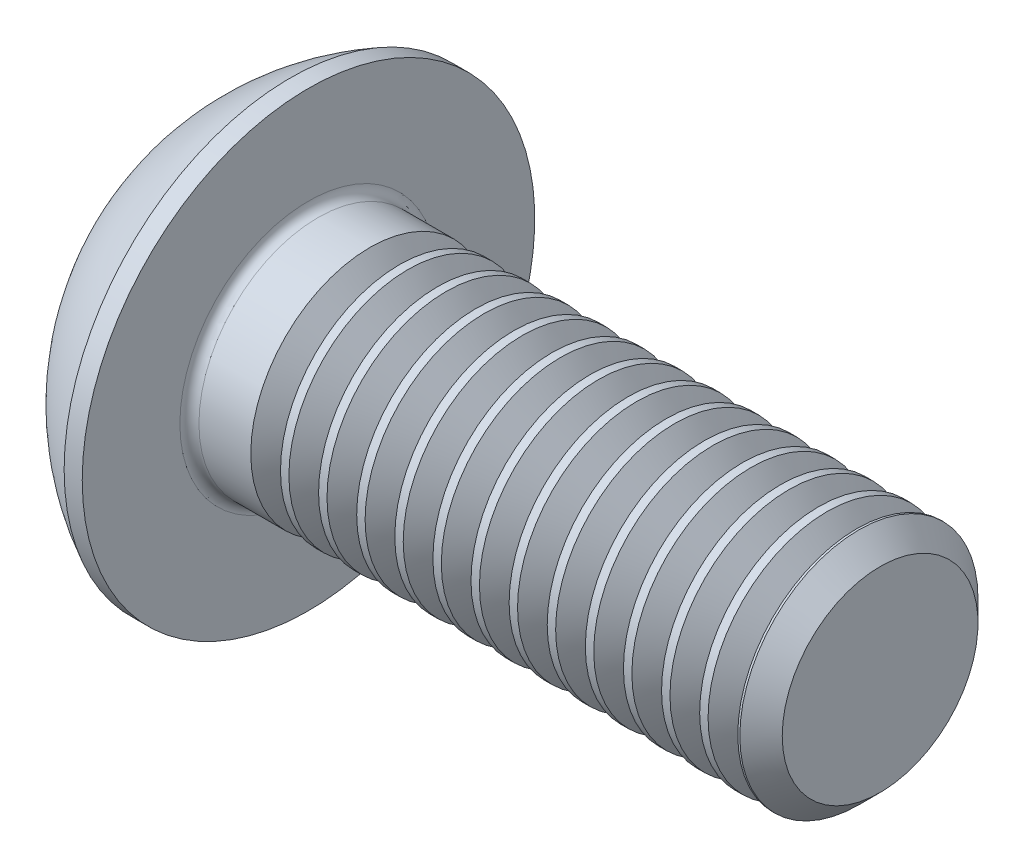
ISO-10303-21;
HEADER;
FILE_DESCRIPTION(('STEP AP214'),'2;1');
FILE_NAME('part.step','',(''),(''),'','','');
FILE_SCHEMA(('AUTOMOTIVE_DESIGN { 1 0 10303 214 1 1 1 1 }'));
ENDSEC;
DATA;
#1=APPLICATION_CONTEXT('core data for automotive mechanical design processes');
#2=APPLICATION_PROTOCOL_DEFINITION('international standard','automotive_design',2000,#1);
#3=PRODUCT_CONTEXT('',#1,'mechanical');
#4=PRODUCT('Part','Part','',(#3));
#5=PRODUCT_RELATED_PRODUCT_CATEGORY('part','',(#4));
#6=PRODUCT_DEFINITION_FORMATION('','',#4);
#7=PRODUCT_DEFINITION_CONTEXT('part definition',#1,'design');
#8=PRODUCT_DEFINITION('design','',#6,#7);
#9=PRODUCT_DEFINITION_SHAPE('','',#8);
#10=(LENGTH_UNIT() NAMED_UNIT(*) SI_UNIT(.MILLI.,.METRE.));
#11=(NAMED_UNIT(*) PLANE_ANGLE_UNIT() SI_UNIT($,.RADIAN.));
#12=(NAMED_UNIT(*) SI_UNIT($,.STERADIAN.) SOLID_ANGLE_UNIT());
#13=UNCERTAINTY_MEASURE_WITH_UNIT(LENGTH_MEASURE(1.E-05),#10,'distance_accuracy_value','');
#14=(GEOMETRIC_REPRESENTATION_CONTEXT(3) GLOBAL_UNCERTAINTY_ASSIGNED_CONTEXT((#13)) GLOBAL_UNIT_ASSIGNED_CONTEXT((#10,
#11,#12)) REPRESENTATION_CONTEXT('',''));
#15=CARTESIAN_POINT('',(0.,0.,0.));
#16=DIRECTION('',(0.,0.,1.));
#17=DIRECTION('',(1.,0.,0.));
#18=AXIS2_PLACEMENT_3D('',#15,#16,#17);
#19=CARTESIAN_POINT('',(0.,0.,0.));
#20=DIRECTION('',(-1.,0.,0.));
#21=DIRECTION('',(0.,0.,1.));
#22=AXIS2_PLACEMENT_3D('',#19,#20,#21);
#23=PLANE('',#22);
#24=CARTESIAN_POINT('',(0.,0.,0.));
#25=DIRECTION('',(-1.,0.,0.));
#26=DIRECTION('',(0.,0.,1.));
#27=AXIS2_PLACEMENT_3D('',#24,#25,#26);
#28=CIRCLE('',#27,2.375);
#29=CARTESIAN_POINT('',(0.,0.,2.375));
#30=VERTEX_POINT('',#29);
#31=EDGE_CURVE('E150',#30,#30,#28,.T.);
#32=ORIENTED_EDGE('',*,*,#31,.T.);
#33=EDGE_LOOP('',(#32));
#34=FACE_BOUND('',#33,.T.);
#35=DIRECTION('',(0.,-1.,0.));
#36=VECTOR('',#35,1.);
#37=CARTESIAN_POINT('',(0.,-0.866025403784438,1.5));
#38=LINE('',#37,#36);
#39=CARTESIAN_POINT('',(0.,0.86602540378444,1.5));
#40=VERTEX_POINT('',#39);
#41=CARTESIAN_POINT('',(0.,-0.866025403784438,1.5));
#42=VERTEX_POINT('',#41);
#43=EDGE_CURVE('E45',#40,#42,#38,.T.);
#44=ORIENTED_EDGE('',*,*,#43,.T.);
#45=DIRECTION('',(0.,-0.5,-0.866025403784439));
#46=VECTOR('',#45,1.);
#47=CARTESIAN_POINT('',(0.,-1.73205080756888,0.));
#48=LINE('',#47,#46);
#49=CARTESIAN_POINT('',(0.,-1.73205080756888,0.));
#50=VERTEX_POINT('',#49);
#51=EDGE_CURVE('E457',#42,#50,#48,.T.);
#52=ORIENTED_EDGE('',*,*,#51,.T.);
#53=DIRECTION('',(0.,0.5,-0.866025403784438));
#54=VECTOR('',#53,1.);
#55=CARTESIAN_POINT('',(0.,-0.866025403784438,-1.5));
#56=LINE('',#55,#54);
#57=CARTESIAN_POINT('',(0.,-0.866025403784438,-1.5));
#58=VERTEX_POINT('',#57);
#59=EDGE_CURVE('E125',#50,#58,#56,.T.);
#60=ORIENTED_EDGE('',*,*,#59,.T.);
#61=DIRECTION('',(0.,1.,0.));
#62=VECTOR('',#61,1.);
#63=CARTESIAN_POINT('',(0.,0.86602540378444,-1.5));
#64=LINE('',#63,#62);
#65=CARTESIAN_POINT('',(0.,0.86602540378444,-1.5));
#66=VERTEX_POINT('',#65);
#67=EDGE_CURVE('E477',#58,#66,#64,.T.);
#68=ORIENTED_EDGE('',*,*,#67,.T.);
#69=DIRECTION('',(0.,0.5,0.866025403784439));
#70=VECTOR('',#69,1.);
#71=CARTESIAN_POINT('',(0.,1.73205080756888,0.));
#72=LINE('',#71,#70);
#73=CARTESIAN_POINT('',(0.,1.73205080756888,0.));
#74=VERTEX_POINT('',#73);
#75=EDGE_CURVE('E479',#66,#74,#72,.T.);
#76=ORIENTED_EDGE('',*,*,#75,.T.);
#77=DIRECTION('',(0.,-0.5,0.866025403784439));
#78=VECTOR('',#77,1.);
#79=CARTESIAN_POINT('',(0.,0.86602540378444,1.5));
#80=LINE('',#79,#78);
#81=EDGE_CURVE('E481',#74,#40,#80,.T.);
#82=ORIENTED_EDGE('',*,*,#81,.T.);
#83=EDGE_LOOP('',(#44,#52,#60,#68,#76,#82));
#84=FACE_BOUND('',#83,.T.);
#85=ADVANCED_FACE('F30',(#34,#84),#23,.T.);
#86=CARTESIAN_POINT('',(4.75501582278481,0.,0.));
#87=DIRECTION('',(-1.,0.,0.));
#88=DIRECTION('',(0.,1.,0.));
#89=AXIS2_PLACEMENT_3D('',#86,#87,#88);
#90=SPHERICAL_SURFACE('',#89,5.3151482081814);
#91=CARTESIAN_POINT('',(2.37,0.,0.));
#92=DIRECTION('',(-1.,0.,0.));
#93=DIRECTION('',(0.,0.,1.));
#94=AXIS2_PLACEMENT_3D('',#91,#92,#93);
#95=CIRCLE('',#94,4.75);
#96=CARTESIAN_POINT('',(2.37,0.,4.75));
#97=VERTEX_POINT('',#96);
#98=EDGE_CURVE('E147',#97,#97,#95,.T.);
#99=ORIENTED_EDGE('',*,*,#98,.T.);
#100=EDGE_LOOP('',(#99));
#101=FACE_BOUND('',#100,.T.);
#102=ORIENTED_EDGE('',*,*,#31,.F.);
#103=EDGE_LOOP('',(#102));
#104=FACE_BOUND('',#103,.T.);
#105=ADVANCED_FACE('F172',(#101,#104),#90,.T.);
#106=CARTESIAN_POINT('',(0.,0.,0.));
#107=DIRECTION('',(-1.,0.,0.));
#108=DIRECTION('',(0.,0.,1.));
#109=AXIS2_PLACEMENT_3D('',#106,#107,#108);
#110=CYLINDRICAL_SURFACE('',#109,4.75);
#111=ORIENTED_EDGE('',*,*,#98,.F.);
#112=EDGE_LOOP('',(#111));
#113=FACE_BOUND('',#112,.T.);
#114=CARTESIAN_POINT('',(2.75,0.,0.));
#115=DIRECTION('',(-1.,0.,0.));
#116=DIRECTION('',(0.,0.,1.));
#117=AXIS2_PLACEMENT_3D('',#114,#115,#116);
#118=CIRCLE('',#117,4.75);
#119=CARTESIAN_POINT('',(2.75,0.,4.75));
#120=VERTEX_POINT('',#119);
#121=EDGE_CURVE('E144',#120,#120,#118,.T.);
#122=ORIENTED_EDGE('',*,*,#121,.T.);
#123=EDGE_LOOP('',(#122));
#124=FACE_BOUND('',#123,.T.);
#125=ADVANCED_FACE('F177',(#113,#124),#110,.T.);
#126=CARTESIAN_POINT('',(2.75,2.49999999999999,0.));
#127=DIRECTION('',(-1.,0.,0.));
#128=DIRECTION('',(0.,0.,1.));
#129=AXIS2_PLACEMENT_3D('',#126,#127,#128);
#130=PLANE('',#129);
#131=CARTESIAN_POINT('',(2.75,0.,0.));
#132=DIRECTION('',(-1.,0.,0.));
#133=DIRECTION('',(0.,0.,1.));
#134=AXIS2_PLACEMENT_3D('',#131,#132,#133);
#135=CIRCLE('',#134,2.69999999999999);
#136=CARTESIAN_POINT('',(2.75,0.,2.69999999999999));
#137=VERTEX_POINT('',#136);
#138=EDGE_CURVE('E38',#137,#137,#135,.T.);
#139=ORIENTED_EDGE('',*,*,#138,.T.);
#140=EDGE_LOOP('',(#139));
#141=FACE_BOUND('',#140,.T.);
#142=ORIENTED_EDGE('',*,*,#121,.F.);
#143=EDGE_LOOP('',(#142));
#144=FACE_BOUND('',#143,.T.);
#145=ADVANCED_FACE('F155',(#141,#144),#130,.F.);
#146=CARTESIAN_POINT('',(0.,0.,0.));
#147=DIRECTION('',(-1.,0.,0.));
#148=DIRECTION('',(0.,0.,1.));
#149=AXIS2_PLACEMENT_3D('',#146,#147,#148);
#150=CYLINDRICAL_SURFACE('',#149,2.49999999999999);
#151=CARTESIAN_POINT('',(4.03840764549667,0.,0.));
#152=DIRECTION('',(-1.,0.,0.));
#153=DIRECTION('',(0.,-1.,0.));
#154=AXIS2_PLACEMENT_3D('',#151,#152,#153);
#155=CIRCLE('',#154,2.5);
#156=CARTESIAN_POINT('',(4.03840764549667,-2.5,0.));
#157=VERTEX_POINT('',#156);
#158=EDGE_CURVE('E452',#157,#157,#155,.T.);
#159=ORIENTED_EDGE('',*,*,#158,.T.);
#160=EDGE_LOOP('',(#159));
#161=FACE_BOUND('',#160,.T.);
#162=CARTESIAN_POINT('',(2.95,0.,0.));
#163=DIRECTION('',(-1.,0.,0.));
#164=DIRECTION('',(0.,0.,1.));
#165=AXIS2_PLACEMENT_3D('',#162,#163,#164);
#166=CIRCLE('',#165,2.49999999999999);
#167=CARTESIAN_POINT('',(2.95,0.,2.49999999999999));
#168=VERTEX_POINT('',#167);
#169=EDGE_CURVE('E11',#168,#168,#166,.F.);
#170=ORIENTED_EDGE('',*,*,#169,.T.);
#171=EDGE_LOOP('',(#170));
#172=FACE_BOUND('',#171,.T.);
#173=ADVANCED_FACE('F159',(#161,#172),#150,.T.);
#174=CARTESIAN_POINT('',(2.95,0.,0.));
#175=DIRECTION('',(-1.,0.,0.));
#176=DIRECTION('',(0.,0.,1.));
#177=AXIS2_PLACEMENT_3D('',#174,#175,#176);
#178=TOROIDAL_SURFACE('',#177,2.69999999999999,0.2);
#179=ORIENTED_EDGE('',*,*,#169,.F.);
#180=EDGE_LOOP('',(#179));
#181=FACE_BOUND('',#180,.T.);
#182=ORIENTED_EDGE('',*,*,#138,.F.);
#183=EDGE_LOOP('',(#182));
#184=FACE_BOUND('',#183,.T.);
#185=ADVANCED_FACE('F32',(#181,#184),#178,.F.);
#186=CARTESIAN_POINT('',(1.56,-1.73205080756888,0.));
#187=DIRECTION('',(0.,0.866025403784438,-0.5));
#188=DIRECTION('',(0.,0.5,0.866025403784439));
#189=AXIS2_PLACEMENT_3D('',#186,#187,#188);
#190=PLANE('',#189);
#191=DIRECTION('',(0.,-0.5,-0.866025403784439));
#192=VECTOR('',#191,1.);
#193=CARTESIAN_POINT('',(1.56,-1.73205080756888,0.));
#194=LINE('',#193,#192);
#195=CARTESIAN_POINT('',(1.56,-0.866025403784438,1.5));
#196=VERTEX_POINT('',#195);
#197=CARTESIAN_POINT('',(1.56,-1.29903810567666,0.75));
#198=VERTEX_POINT('',#197);
#199=EDGE_CURVE('E111',#196,#198,#194,.T.);
#200=ORIENTED_EDGE('',*,*,#199,.T.);
#201=CARTESIAN_POINT('',(1.56,-1.73205080756888,0.));
#202=VERTEX_POINT('',#201);
#203=EDGE_CURVE('E106',#198,#202,#194,.T.);
#204=ORIENTED_EDGE('',*,*,#203,.T.);
#205=DIRECTION('',(-1.,0.,0.));
#206=VECTOR('',#205,1.);
#207=CARTESIAN_POINT('',(1.56,-1.73205080756888,0.));
#208=LINE('',#207,#206);
#209=EDGE_CURVE('E108',#202,#50,#208,.T.);
#210=ORIENTED_EDGE('',*,*,#209,.T.);
#211=ORIENTED_EDGE('',*,*,#51,.F.);
#212=DIRECTION('',(-1.,0.,0.));
#213=VECTOR('',#212,1.);
#214=CARTESIAN_POINT('',(1.56,-0.866025403784438,1.5));
#215=LINE('',#214,#213);
#216=EDGE_CURVE('E474',#196,#42,#215,.T.);
#217=ORIENTED_EDGE('',*,*,#216,.F.);
#218=EDGE_LOOP('',(#200,#204,#210,#211,#217));
#219=FACE_BOUND('',#218,.T.);
#220=ADVANCED_FACE('F107',(#219),#190,.T.);
#221=CARTESIAN_POINT('',(1.56,-0.866025403784438,-1.5));
#222=DIRECTION('',(0.,0.866025403784438,0.5));
#223=DIRECTION('',(0.,-0.5,0.866025403784439));
#224=AXIS2_PLACEMENT_3D('',#221,#222,#223);
#225=PLANE('',#224);
#226=DIRECTION('',(0.,0.5,-0.866025403784438));
#227=VECTOR('',#226,1.);
#228=CARTESIAN_POINT('',(1.56,-0.866025403784438,-1.5));
#229=LINE('',#228,#227);
#230=CARTESIAN_POINT('',(1.56,-1.29903810567666,-0.75));
#231=VERTEX_POINT('',#230);
#232=EDGE_CURVE('E53',#202,#231,#229,.T.);
#233=ORIENTED_EDGE('',*,*,#232,.T.);
#234=CARTESIAN_POINT('',(1.56,-0.866025403784438,-1.5));
#235=VERTEX_POINT('',#234);
#236=EDGE_CURVE('E120',#231,#235,#229,.T.);
#237=ORIENTED_EDGE('',*,*,#236,.T.);
#238=DIRECTION('',(-1.,0.,0.));
#239=VECTOR('',#238,1.);
#240=CARTESIAN_POINT('',(1.56,-0.866025403784438,-1.5));
#241=LINE('',#240,#239);
#242=EDGE_CURVE('E127',#235,#58,#241,.T.);
#243=ORIENTED_EDGE('',*,*,#242,.T.);
#244=ORIENTED_EDGE('',*,*,#59,.F.);
#245=ORIENTED_EDGE('',*,*,#209,.F.);
#246=EDGE_LOOP('',(#233,#237,#243,#244,#245));
#247=FACE_BOUND('',#246,.T.);
#248=ADVANCED_FACE('F123',(#247),#225,.T.);
#249=CARTESIAN_POINT('',(1.56,0.86602540378444,-1.5));
#250=DIRECTION('',(0.,0.,1.));
#251=DIRECTION('',(1.,0.,0.));
#252=AXIS2_PLACEMENT_3D('',#249,#250,#251);
#253=PLANE('',#252);
#254=DIRECTION('',(0.,1.,0.));
#255=VECTOR('',#254,1.);
#256=CARTESIAN_POINT('',(1.56,0.86602540378444,-1.5));
#257=LINE('',#256,#255);
#258=CARTESIAN_POINT('',(1.56,0.,-1.5));
#259=VERTEX_POINT('',#258);
#260=EDGE_CURVE('E459',#235,#259,#257,.T.);
#261=ORIENTED_EDGE('',*,*,#260,.T.);
#262=CARTESIAN_POINT('',(1.56,0.86602540378444,-1.5));
#263=VERTEX_POINT('',#262);
#264=EDGE_CURVE('E119',#259,#263,#257,.T.);
#265=ORIENTED_EDGE('',*,*,#264,.T.);
#266=DIRECTION('',(-1.,0.,0.));
#267=VECTOR('',#266,1.);
#268=CARTESIAN_POINT('',(1.56,0.86602540378444,-1.5));
#269=LINE('',#268,#267);
#270=EDGE_CURVE('E132',#263,#66,#269,.T.);
#271=ORIENTED_EDGE('',*,*,#270,.T.);
#272=ORIENTED_EDGE('',*,*,#67,.F.);
#273=ORIENTED_EDGE('',*,*,#242,.F.);
#274=EDGE_LOOP('',(#261,#265,#271,#272,#273));
#275=FACE_BOUND('',#274,.T.);
#276=ADVANCED_FACE('F203',(#275),#253,.T.);
#277=CARTESIAN_POINT('',(1.56,1.73205080756888,0.));
#278=DIRECTION('',(0.,-0.866025403784439,0.5));
#279=DIRECTION('',(0.,-0.5,-0.866025403784439));
#280=AXIS2_PLACEMENT_3D('',#277,#278,#279);
#281=PLANE('',#280);
#282=DIRECTION('',(0.,0.5,0.866025403784439));
#283=VECTOR('',#282,1.);
#284=CARTESIAN_POINT('',(1.56,1.73205080756888,0.));
#285=LINE('',#284,#283);
#286=CARTESIAN_POINT('',(1.56,1.29903810567666,-0.750000000000001));
#287=VERTEX_POINT('',#286);
#288=EDGE_CURVE('E463',#263,#287,#285,.T.);
#289=ORIENTED_EDGE('',*,*,#288,.T.);
#290=CARTESIAN_POINT('',(1.56,1.73205080756888,0.));
#291=VERTEX_POINT('',#290);
#292=EDGE_CURVE('E462',#287,#291,#285,.T.);
#293=ORIENTED_EDGE('',*,*,#292,.T.);
#294=DIRECTION('',(-1.,0.,0.));
#295=VECTOR('',#294,1.);
#296=CARTESIAN_POINT('',(1.56,1.73205080756888,0.));
#297=LINE('',#296,#295);
#298=EDGE_CURVE('E489',#291,#74,#297,.T.);
#299=ORIENTED_EDGE('',*,*,#298,.T.);
#300=ORIENTED_EDGE('',*,*,#75,.F.);
#301=ORIENTED_EDGE('',*,*,#270,.F.);
#302=EDGE_LOOP('',(#289,#293,#299,#300,#301));
#303=FACE_BOUND('',#302,.T.);
#304=ADVANCED_FACE('F206',(#303),#281,.T.);
#305=CARTESIAN_POINT('',(1.56,0.86602540378444,1.5));
#306=DIRECTION('',(0.,-0.866025403784439,-0.5));
#307=DIRECTION('',(0.,0.5,-0.866025403784439));
#308=AXIS2_PLACEMENT_3D('',#305,#306,#307);
#309=PLANE('',#308);
#310=DIRECTION('',(0.,-0.5,0.866025403784439));
#311=VECTOR('',#310,1.);
#312=CARTESIAN_POINT('',(1.56,0.86602540378444,1.5));
#313=LINE('',#312,#311);
#314=CARTESIAN_POINT('',(1.56,1.29903810567666,0.75));
#315=VERTEX_POINT('',#314);
#316=EDGE_CURVE('E467',#291,#315,#313,.T.);
#317=ORIENTED_EDGE('',*,*,#316,.T.);
#318=CARTESIAN_POINT('',(1.56,0.86602540378444,1.5));
#319=VERTEX_POINT('',#318);
#320=EDGE_CURVE('E466',#315,#319,#313,.T.);
#321=ORIENTED_EDGE('',*,*,#320,.T.);
#322=DIRECTION('',(-1.,0.,0.));
#323=VECTOR('',#322,1.);
#324=CARTESIAN_POINT('',(1.56,0.86602540378444,1.5));
#325=LINE('',#324,#323);
#326=EDGE_CURVE('E486',#319,#40,#325,.T.);
#327=ORIENTED_EDGE('',*,*,#326,.T.);
#328=ORIENTED_EDGE('',*,*,#81,.F.);
#329=ORIENTED_EDGE('',*,*,#298,.F.);
#330=EDGE_LOOP('',(#317,#321,#327,#328,#329));
#331=FACE_BOUND('',#330,.T.);
#332=ADVANCED_FACE('F210',(#331),#309,.T.);
#333=CARTESIAN_POINT('',(1.56,-0.866025403784438,1.5));
#334=DIRECTION('',(0.,0.,-1.));
#335=DIRECTION('',(0.,1.,0.));
#336=AXIS2_PLACEMENT_3D('',#333,#334,#335);
#337=PLANE('',#336);
#338=DIRECTION('',(0.,-1.,0.));
#339=VECTOR('',#338,1.);
#340=CARTESIAN_POINT('',(1.56,-0.866025403784438,1.5));
#341=LINE('',#340,#339);
#342=CARTESIAN_POINT('',(1.56,0.,1.5));
#343=VERTEX_POINT('',#342);
#344=EDGE_CURVE('E471',#319,#343,#341,.T.);
#345=ORIENTED_EDGE('',*,*,#344,.T.);
#346=EDGE_CURVE('E470',#343,#196,#341,.T.);
#347=ORIENTED_EDGE('',*,*,#346,.T.);
#348=ORIENTED_EDGE('',*,*,#216,.T.);
#349=ORIENTED_EDGE('',*,*,#43,.F.);
#350=ORIENTED_EDGE('',*,*,#326,.F.);
#351=EDGE_LOOP('',(#345,#347,#348,#349,#350));
#352=FACE_BOUND('',#351,.T.);
#353=ADVANCED_FACE('F214',(#352),#337,.T.);
#354=CARTESIAN_POINT('',(1.56,-1.73205080756888,0.));
#355=DIRECTION('',(1.,0.,0.));
#356=DIRECTION('',(0.,0.,-1.));
#357=AXIS2_PLACEMENT_3D('',#354,#355,#356);
#358=PLANE('',#357);
#359=CARTESIAN_POINT('',(1.56,0.,0.));
#360=DIRECTION('',(-1.,0.,0.));
#361=DIRECTION('',(0.,0.,1.));
#362=AXIS2_PLACEMENT_3D('',#359,#360,#361);
#363=CIRCLE('',#362,1.5);
#364=EDGE_CURVE('E503',#287,#259,#363,.T.);
#365=ORIENTED_EDGE('',*,*,#364,.F.);
#366=ORIENTED_EDGE('',*,*,#288,.F.);
#367=ORIENTED_EDGE('',*,*,#264,.F.);
#368=EDGE_LOOP('',(#365,#366,#367));
#369=FACE_BOUND('',#368,.T.);
#370=ADVANCED_FACE('F218',(#369),#358,.F.);
#371=EDGE_CURVE('E138',#315,#287,#363,.T.);
#372=ORIENTED_EDGE('',*,*,#371,.F.);
#373=ORIENTED_EDGE('',*,*,#316,.F.);
#374=ORIENTED_EDGE('',*,*,#292,.F.);
#375=EDGE_LOOP('',(#372,#373,#374));
#376=FACE_BOUND('',#375,.T.);
#377=ADVANCED_FACE('F511',(#376),#358,.F.);
#378=EDGE_CURVE('E131',#343,#315,#363,.T.);
#379=ORIENTED_EDGE('',*,*,#378,.F.);
#380=ORIENTED_EDGE('',*,*,#344,.F.);
#381=ORIENTED_EDGE('',*,*,#320,.F.);
#382=EDGE_LOOP('',(#379,#380,#381));
#383=FACE_BOUND('',#382,.T.);
#384=ADVANCED_FACE('F514',(#383),#358,.F.);
#385=EDGE_CURVE('E126',#198,#343,#363,.T.);
#386=ORIENTED_EDGE('',*,*,#385,.F.);
#387=ORIENTED_EDGE('',*,*,#199,.F.);
#388=ORIENTED_EDGE('',*,*,#346,.F.);
#389=EDGE_LOOP('',(#386,#387,#388));
#390=FACE_BOUND('',#389,.T.);
#391=ADVANCED_FACE('F518',(#390),#358,.F.);
#392=EDGE_CURVE('E117',#231,#198,#363,.T.);
#393=ORIENTED_EDGE('',*,*,#392,.F.);
#394=ORIENTED_EDGE('',*,*,#232,.F.);
#395=ORIENTED_EDGE('',*,*,#203,.F.);
#396=EDGE_LOOP('',(#393,#394,#395));
#397=FACE_BOUND('',#396,.T.);
#398=ADVANCED_FACE('F116',(#397),#358,.F.);
#399=EDGE_CURVE('E502',#259,#231,#363,.T.);
#400=ORIENTED_EDGE('',*,*,#399,.F.);
#401=ORIENTED_EDGE('',*,*,#260,.F.);
#402=ORIENTED_EDGE('',*,*,#236,.F.);
#403=EDGE_LOOP('',(#400,#401,#402));
#404=FACE_BOUND('',#403,.T.);
#405=ADVANCED_FACE('F198',(#404),#358,.F.);
#406=CARTESIAN_POINT('',(2.42602540378445,0.,0.));
#407=DIRECTION('',(-1.,0.,0.));
#408=DIRECTION('',(0.,0.,1.));
#409=AXIS2_PLACEMENT_3D('',#406,#407,#408);
#410=CONICAL_SURFACE('',#409,0.,1.04719755119659);
#411=ORIENTED_EDGE('',*,*,#378,.T.);
#412=ORIENTED_EDGE('',*,*,#371,.T.);
#413=ORIENTED_EDGE('',*,*,#364,.T.);
#414=ORIENTED_EDGE('',*,*,#399,.T.);
#415=ORIENTED_EDGE('',*,*,#392,.T.);
#416=ORIENTED_EDGE('',*,*,#385,.T.);
#417=EDGE_LOOP('',(#411,#412,#413,#414,#415,#416));
#418=FACE_BOUND('',#417,.T.);
#419=CARTESIAN_POINT('',(2.42602540378445,0.,0.));
#420=VERTEX_POINT('',#419);
#421=VERTEX_LOOP('',#420);
#422=FACE_BOUND('',#421,.T.);
#423=ADVANCED_FACE('F195',(#418,#422),#410,.F.);
#424=CARTESIAN_POINT('',(4.66159235450332,0.,0.));
#425=DIRECTION('',(1.,0.,0.));
#426=DIRECTION('',(0.,1.,0.));
#427=AXIS2_PLACEMENT_3D('',#424,#425,#426);
#428=CONICAL_SURFACE('',#427,2.5,0.959931088596882);
#429=CARTESIAN_POINT('',(4.35,0.,0.));
#430=DIRECTION('',(-1.,0.,0.));
#431=DIRECTION('',(0.,-1.,0.));
#432=AXIS2_PLACEMENT_3D('',#429,#430,#431);
#433=CIRCLE('',#432,2.055);
#434=CARTESIAN_POINT('',(4.35,-2.055,0.));
#435=VERTEX_POINT('',#434);
#436=EDGE_CURVE('E449',#435,#435,#433,.T.);
#437=ORIENTED_EDGE('',*,*,#436,.F.);
#438=EDGE_LOOP('',(#437));
#439=FACE_BOUND('',#438,.T.);
#440=CARTESIAN_POINT('',(4.66159235450332,0.,0.));
#441=DIRECTION('',(-1.,0.,0.));
#442=DIRECTION('',(0.,-1.,0.));
#443=AXIS2_PLACEMENT_3D('',#440,#441,#442);
#444=CIRCLE('',#443,2.5);
#445=CARTESIAN_POINT('',(4.66159235450332,-2.5,0.));
#446=VERTEX_POINT('',#445);
#447=EDGE_CURVE('E455',#446,#446,#444,.T.);
#448=ORIENTED_EDGE('',*,*,#447,.T.);
#449=EDGE_LOOP('',(#448));
#450=FACE_BOUND('',#449,.T.);
#451=ADVANCED_FACE('F197',(#439,#450),#428,.T.);
#452=CARTESIAN_POINT('',(4.35,0.,0.));
#453=DIRECTION('',(-1.,0.,0.));
#454=DIRECTION('',(0.,-1.,0.));
#455=AXIS2_PLACEMENT_3D('',#452,#453,#454);
#456=CONICAL_SURFACE('',#455,2.055,0.959931088596878);
#457=ORIENTED_EDGE('',*,*,#158,.F.);
#458=EDGE_LOOP('',(#457));
#459=FACE_BOUND('',#458,.T.);
#460=ORIENTED_EDGE('',*,*,#436,.T.);
#461=EDGE_LOOP('',(#460));
#462=FACE_BOUND('',#461,.T.);
#463=ADVANCED_FACE('F225',(#459,#462),#456,.T.);
#464=CARTESIAN_POINT('',(4.83840764549667,0.,0.));
#465=DIRECTION('',(-1.,0.,0.));
#466=DIRECTION('',(0.,-1.,0.));
#467=AXIS2_PLACEMENT_3D('',#464,#465,#466);
#468=CIRCLE('',#467,2.5);
#469=CARTESIAN_POINT('',(4.83840764549667,-2.5,0.));
#470=VERTEX_POINT('',#469);
#471=EDGE_CURVE('E443',#470,#470,#468,.T.);
#472=ORIENTED_EDGE('',*,*,#471,.T.);
#473=EDGE_LOOP('',(#472));
#474=FACE_BOUND('',#473,.T.);
#475=ORIENTED_EDGE('',*,*,#447,.F.);
#476=EDGE_LOOP('',(#475));
#477=FACE_BOUND('',#476,.T.);
#478=ADVANCED_FACE('F169',(#474,#477),#150,.T.);
#479=CARTESIAN_POINT('',(5.46159235450332,0.,0.));
#480=DIRECTION('',(1.,0.,0.));
#481=DIRECTION('',(0.,1.,0.));
#482=AXIS2_PLACEMENT_3D('',#479,#480,#481);
#483=CONICAL_SURFACE('',#482,2.5,0.959931088596882);
#484=CARTESIAN_POINT('',(5.15,0.,0.));
#485=DIRECTION('',(-1.,0.,0.));
#486=DIRECTION('',(0.,-1.,0.));
#487=AXIS2_PLACEMENT_3D('',#484,#485,#486);
#488=CIRCLE('',#487,2.055);
#489=CARTESIAN_POINT('',(5.15,-2.055,0.));
#490=VERTEX_POINT('',#489);
#491=EDGE_CURVE('E440',#490,#490,#488,.T.);
#492=ORIENTED_EDGE('',*,*,#491,.F.);
#493=EDGE_LOOP('',(#492));
#494=FACE_BOUND('',#493,.T.);
#495=CARTESIAN_POINT('',(5.46159235450332,0.,0.));
#496=DIRECTION('',(-1.,0.,0.));
#497=DIRECTION('',(0.,-1.,0.));
#498=AXIS2_PLACEMENT_3D('',#495,#496,#497);
#499=CIRCLE('',#498,2.5);
#500=CARTESIAN_POINT('',(5.46159235450332,-2.5,0.));
#501=VERTEX_POINT('',#500);
#502=EDGE_CURVE('E446',#501,#501,#499,.T.);
#503=ORIENTED_EDGE('',*,*,#502,.T.);
#504=EDGE_LOOP('',(#503));
#505=FACE_BOUND('',#504,.T.);
#506=ADVANCED_FACE('F230',(#494,#505),#483,.T.);
#507=CARTESIAN_POINT('',(5.15,0.,0.));
#508=DIRECTION('',(-1.,0.,0.));
#509=DIRECTION('',(0.,-1.,0.));
#510=AXIS2_PLACEMENT_3D('',#507,#508,#509);
#511=CONICAL_SURFACE('',#510,2.055,0.959931088596878);
#512=ORIENTED_EDGE('',*,*,#471,.F.);
#513=EDGE_LOOP('',(#512));
#514=FACE_BOUND('',#513,.T.);
#515=ORIENTED_EDGE('',*,*,#491,.T.);
#516=EDGE_LOOP('',(#515));
#517=FACE_BOUND('',#516,.T.);
#518=ADVANCED_FACE('F233',(#514,#517),#511,.T.);
#519=CARTESIAN_POINT('',(5.63840764549667,0.,0.));
#520=DIRECTION('',(-1.,0.,0.));
#521=DIRECTION('',(0.,-1.,0.));
#522=AXIS2_PLACEMENT_3D('',#519,#520,#521);
#523=CIRCLE('',#522,2.5);
#524=CARTESIAN_POINT('',(5.63840764549667,-2.5,0.));
#525=VERTEX_POINT('',#524);
#526=EDGE_CURVE('E434',#525,#525,#523,.T.);
#527=ORIENTED_EDGE('',*,*,#526,.T.);
#528=EDGE_LOOP('',(#527));
#529=FACE_BOUND('',#528,.T.);
#530=ORIENTED_EDGE('',*,*,#502,.F.);
#531=EDGE_LOOP('',(#530));
#532=FACE_BOUND('',#531,.T.);
#533=ADVANCED_FACE('F237',(#529,#532),#150,.T.);
#534=CARTESIAN_POINT('',(6.26159235450332,0.,0.));
#535=DIRECTION('',(1.,0.,0.));
#536=DIRECTION('',(0.,1.,0.));
#537=AXIS2_PLACEMENT_3D('',#534,#535,#536);
#538=CONICAL_SURFACE('',#537,2.5,0.959931088596882);
#539=CARTESIAN_POINT('',(5.95,0.,0.));
#540=DIRECTION('',(-1.,0.,0.));
#541=DIRECTION('',(0.,-1.,0.));
#542=AXIS2_PLACEMENT_3D('',#539,#540,#541);
#543=CIRCLE('',#542,2.055);
#544=CARTESIAN_POINT('',(5.95,-2.055,0.));
#545=VERTEX_POINT('',#544);
#546=EDGE_CURVE('E431',#545,#545,#543,.T.);
#547=ORIENTED_EDGE('',*,*,#546,.F.);
#548=EDGE_LOOP('',(#547));
#549=FACE_BOUND('',#548,.T.);
#550=CARTESIAN_POINT('',(6.26159235450332,0.,0.));
#551=DIRECTION('',(-1.,0.,0.));
#552=DIRECTION('',(0.,-1.,0.));
#553=AXIS2_PLACEMENT_3D('',#550,#551,#552);
#554=CIRCLE('',#553,2.5);
#555=CARTESIAN_POINT('',(6.26159235450332,-2.5,0.));
#556=VERTEX_POINT('',#555);
#557=EDGE_CURVE('E437',#556,#556,#554,.T.);
#558=ORIENTED_EDGE('',*,*,#557,.T.);
#559=EDGE_LOOP('',(#558));
#560=FACE_BOUND('',#559,.T.);
#561=ADVANCED_FACE('F239',(#549,#560),#538,.T.);
#562=CARTESIAN_POINT('',(5.95,0.,0.));
#563=DIRECTION('',(-1.,0.,0.));
#564=DIRECTION('',(0.,-1.,0.));
#565=AXIS2_PLACEMENT_3D('',#562,#563,#564);
#566=CONICAL_SURFACE('',#565,2.055,0.959931088596878);
#567=ORIENTED_EDGE('',*,*,#526,.F.);
#568=EDGE_LOOP('',(#567));
#569=FACE_BOUND('',#568,.T.);
#570=ORIENTED_EDGE('',*,*,#546,.T.);
#571=EDGE_LOOP('',(#570));
#572=FACE_BOUND('',#571,.T.);
#573=ADVANCED_FACE('F242',(#569,#572),#566,.T.);
#574=CARTESIAN_POINT('',(6.43840764549667,0.,0.));
#575=DIRECTION('',(-1.,0.,0.));
#576=DIRECTION('',(0.,-1.,0.));
#577=AXIS2_PLACEMENT_3D('',#574,#575,#576);
#578=CIRCLE('',#577,2.5);
#579=CARTESIAN_POINT('',(6.43840764549667,-2.5,0.));
#580=VERTEX_POINT('',#579);
#581=EDGE_CURVE('E425',#580,#580,#578,.T.);
#582=ORIENTED_EDGE('',*,*,#581,.T.);
#583=EDGE_LOOP('',(#582));
#584=FACE_BOUND('',#583,.T.);
#585=ORIENTED_EDGE('',*,*,#557,.F.);
#586=EDGE_LOOP('',(#585));
#587=FACE_BOUND('',#586,.T.);
#588=ADVANCED_FACE('F246',(#584,#587),#150,.T.);
#589=CARTESIAN_POINT('',(7.06159235450332,0.,0.));
#590=DIRECTION('',(1.,0.,0.));
#591=DIRECTION('',(0.,1.,0.));
#592=AXIS2_PLACEMENT_3D('',#589,#590,#591);
#593=CONICAL_SURFACE('',#592,2.5,0.959931088596882);
#594=CARTESIAN_POINT('',(6.75,0.,0.));
#595=DIRECTION('',(-1.,0.,0.));
#596=DIRECTION('',(0.,-1.,0.));
#597=AXIS2_PLACEMENT_3D('',#594,#595,#596);
#598=CIRCLE('',#597,2.055);
#599=CARTESIAN_POINT('',(6.75,-2.055,0.));
#600=VERTEX_POINT('',#599);
#601=EDGE_CURVE('E422',#600,#600,#598,.T.);
#602=ORIENTED_EDGE('',*,*,#601,.F.);
#603=EDGE_LOOP('',(#602));
#604=FACE_BOUND('',#603,.T.);
#605=CARTESIAN_POINT('',(7.06159235450332,0.,0.));
#606=DIRECTION('',(-1.,0.,0.));
#607=DIRECTION('',(0.,-1.,0.));
#608=AXIS2_PLACEMENT_3D('',#605,#606,#607);
#609=CIRCLE('',#608,2.5);
#610=CARTESIAN_POINT('',(7.06159235450332,-2.5,0.));
#611=VERTEX_POINT('',#610);
#612=EDGE_CURVE('E428',#611,#611,#609,.T.);
#613=ORIENTED_EDGE('',*,*,#612,.T.);
#614=EDGE_LOOP('',(#613));
#615=FACE_BOUND('',#614,.T.);
#616=ADVANCED_FACE('F248',(#604,#615),#593,.T.);
#617=CARTESIAN_POINT('',(6.75,0.,0.));
#618=DIRECTION('',(-1.,0.,0.));
#619=DIRECTION('',(0.,-1.,0.));
#620=AXIS2_PLACEMENT_3D('',#617,#618,#619);
#621=CONICAL_SURFACE('',#620,2.055,0.959931088596878);
#622=ORIENTED_EDGE('',*,*,#581,.F.);
#623=EDGE_LOOP('',(#622));
#624=FACE_BOUND('',#623,.T.);
#625=ORIENTED_EDGE('',*,*,#601,.T.);
#626=EDGE_LOOP('',(#625));
#627=FACE_BOUND('',#626,.T.);
#628=ADVANCED_FACE('F251',(#624,#627),#621,.T.);
#629=CARTESIAN_POINT('',(7.23840764549667,0.,0.));
#630=DIRECTION('',(-1.,0.,0.));
#631=DIRECTION('',(0.,-1.,0.));
#632=AXIS2_PLACEMENT_3D('',#629,#630,#631);
#633=CIRCLE('',#632,2.5);
#634=CARTESIAN_POINT('',(7.23840764549667,-2.5,0.));
#635=VERTEX_POINT('',#634);
#636=EDGE_CURVE('E416',#635,#635,#633,.T.);
#637=ORIENTED_EDGE('',*,*,#636,.T.);
#638=EDGE_LOOP('',(#637));
#639=FACE_BOUND('',#638,.T.);
#640=ORIENTED_EDGE('',*,*,#612,.F.);
#641=EDGE_LOOP('',(#640));
#642=FACE_BOUND('',#641,.T.);
#643=ADVANCED_FACE('F255',(#639,#642),#150,.T.);
#644=CARTESIAN_POINT('',(7.86159235450332,0.,0.));
#645=DIRECTION('',(1.,0.,0.));
#646=DIRECTION('',(0.,1.,0.));
#647=AXIS2_PLACEMENT_3D('',#644,#645,#646);
#648=CONICAL_SURFACE('',#647,2.5,0.959931088596882);
#649=CARTESIAN_POINT('',(7.55,0.,0.));
#650=DIRECTION('',(-1.,0.,0.));
#651=DIRECTION('',(0.,-1.,0.));
#652=AXIS2_PLACEMENT_3D('',#649,#650,#651);
#653=CIRCLE('',#652,2.055);
#654=CARTESIAN_POINT('',(7.55,-2.055,0.));
#655=VERTEX_POINT('',#654);
#656=EDGE_CURVE('E413',#655,#655,#653,.T.);
#657=ORIENTED_EDGE('',*,*,#656,.F.);
#658=EDGE_LOOP('',(#657));
#659=FACE_BOUND('',#658,.T.);
#660=CARTESIAN_POINT('',(7.86159235450332,0.,0.));
#661=DIRECTION('',(-1.,0.,0.));
#662=DIRECTION('',(0.,-1.,0.));
#663=AXIS2_PLACEMENT_3D('',#660,#661,#662);
#664=CIRCLE('',#663,2.5);
#665=CARTESIAN_POINT('',(7.86159235450332,-2.5,0.));
#666=VERTEX_POINT('',#665);
#667=EDGE_CURVE('E419',#666,#666,#664,.T.);
#668=ORIENTED_EDGE('',*,*,#667,.T.);
#669=EDGE_LOOP('',(#668));
#670=FACE_BOUND('',#669,.T.);
#671=ADVANCED_FACE('F257',(#659,#670),#648,.T.);
#672=CARTESIAN_POINT('',(7.55,0.,0.));
#673=DIRECTION('',(-1.,0.,0.));
#674=DIRECTION('',(0.,-1.,0.));
#675=AXIS2_PLACEMENT_3D('',#672,#673,#674);
#676=CONICAL_SURFACE('',#675,2.055,0.959931088596878);
#677=ORIENTED_EDGE('',*,*,#636,.F.);
#678=EDGE_LOOP('',(#677));
#679=FACE_BOUND('',#678,.T.);
#680=ORIENTED_EDGE('',*,*,#656,.T.);
#681=EDGE_LOOP('',(#680));
#682=FACE_BOUND('',#681,.T.);
#683=ADVANCED_FACE('F260',(#679,#682),#676,.T.);
#684=CARTESIAN_POINT('',(8.03840764549667,0.,0.));
#685=DIRECTION('',(-1.,0.,0.));
#686=DIRECTION('',(0.,-1.,0.));
#687=AXIS2_PLACEMENT_3D('',#684,#685,#686);
#688=CIRCLE('',#687,2.5);
#689=CARTESIAN_POINT('',(8.03840764549667,-2.5,0.));
#690=VERTEX_POINT('',#689);
#691=EDGE_CURVE('E407',#690,#690,#688,.T.);
#692=ORIENTED_EDGE('',*,*,#691,.T.);
#693=EDGE_LOOP('',(#692));
#694=FACE_BOUND('',#693,.T.);
#695=ORIENTED_EDGE('',*,*,#667,.F.);
#696=EDGE_LOOP('',(#695));
#697=FACE_BOUND('',#696,.T.);
#698=ADVANCED_FACE('F264',(#694,#697),#150,.T.);
#699=CARTESIAN_POINT('',(8.66159235450332,0.,0.));
#700=DIRECTION('',(1.,0.,0.));
#701=DIRECTION('',(0.,1.,0.));
#702=AXIS2_PLACEMENT_3D('',#699,#700,#701);
#703=CONICAL_SURFACE('',#702,2.5,0.959931088596882);
#704=CARTESIAN_POINT('',(8.35,0.,0.));
#705=DIRECTION('',(-1.,0.,0.));
#706=DIRECTION('',(0.,-1.,0.));
#707=AXIS2_PLACEMENT_3D('',#704,#705,#706);
#708=CIRCLE('',#707,2.055);
#709=CARTESIAN_POINT('',(8.35,-2.055,0.));
#710=VERTEX_POINT('',#709);
#711=EDGE_CURVE('E404',#710,#710,#708,.T.);
#712=ORIENTED_EDGE('',*,*,#711,.F.);
#713=EDGE_LOOP('',(#712));
#714=FACE_BOUND('',#713,.T.);
#715=CARTESIAN_POINT('',(8.66159235450332,0.,0.));
#716=DIRECTION('',(-1.,0.,0.));
#717=DIRECTION('',(0.,-1.,0.));
#718=AXIS2_PLACEMENT_3D('',#715,#716,#717);
#719=CIRCLE('',#718,2.5);
#720=CARTESIAN_POINT('',(8.66159235450332,-2.5,0.));
#721=VERTEX_POINT('',#720);
#722=EDGE_CURVE('E410',#721,#721,#719,.T.);
#723=ORIENTED_EDGE('',*,*,#722,.T.);
#724=EDGE_LOOP('',(#723));
#725=FACE_BOUND('',#724,.T.);
#726=ADVANCED_FACE('F266',(#714,#725),#703,.T.);
#727=CARTESIAN_POINT('',(8.35,0.,0.));
#728=DIRECTION('',(-1.,0.,0.));
#729=DIRECTION('',(0.,-1.,0.));
#730=AXIS2_PLACEMENT_3D('',#727,#728,#729);
#731=CONICAL_SURFACE('',#730,2.055,0.959931088596878);
#732=ORIENTED_EDGE('',*,*,#691,.F.);
#733=EDGE_LOOP('',(#732));
#734=FACE_BOUND('',#733,.T.);
#735=ORIENTED_EDGE('',*,*,#711,.T.);
#736=EDGE_LOOP('',(#735));
#737=FACE_BOUND('',#736,.T.);
#738=ADVANCED_FACE('F269',(#734,#737),#731,.T.);
#739=CARTESIAN_POINT('',(8.83840764549667,0.,0.));
#740=DIRECTION('',(-1.,0.,0.));
#741=DIRECTION('',(0.,-1.,0.));
#742=AXIS2_PLACEMENT_3D('',#739,#740,#741);
#743=CIRCLE('',#742,2.5);
#744=CARTESIAN_POINT('',(8.83840764549667,-2.5,0.));
#745=VERTEX_POINT('',#744);
#746=EDGE_CURVE('E398',#745,#745,#743,.T.);
#747=ORIENTED_EDGE('',*,*,#746,.T.);
#748=EDGE_LOOP('',(#747));
#749=FACE_BOUND('',#748,.T.);
#750=ORIENTED_EDGE('',*,*,#722,.F.);
#751=EDGE_LOOP('',(#750));
#752=FACE_BOUND('',#751,.T.);
#753=ADVANCED_FACE('F273',(#749,#752),#150,.T.);
#754=CARTESIAN_POINT('',(9.46159235450332,0.,0.));
#755=DIRECTION('',(1.,0.,0.));
#756=DIRECTION('',(0.,1.,0.));
#757=AXIS2_PLACEMENT_3D('',#754,#755,#756);
#758=CONICAL_SURFACE('',#757,2.5,0.959931088596882);
#759=CARTESIAN_POINT('',(9.15,0.,0.));
#760=DIRECTION('',(-1.,0.,0.));
#761=DIRECTION('',(0.,-1.,0.));
#762=AXIS2_PLACEMENT_3D('',#759,#760,#761);
#763=CIRCLE('',#762,2.055);
#764=CARTESIAN_POINT('',(9.15,-2.055,0.));
#765=VERTEX_POINT('',#764);
#766=EDGE_CURVE('E395',#765,#765,#763,.T.);
#767=ORIENTED_EDGE('',*,*,#766,.F.);
#768=EDGE_LOOP('',(#767));
#769=FACE_BOUND('',#768,.T.);
#770=CARTESIAN_POINT('',(9.46159235450332,0.,0.));
#771=DIRECTION('',(-1.,0.,0.));
#772=DIRECTION('',(0.,-1.,0.));
#773=AXIS2_PLACEMENT_3D('',#770,#771,#772);
#774=CIRCLE('',#773,2.5);
#775=CARTESIAN_POINT('',(9.46159235450332,-2.5,0.));
#776=VERTEX_POINT('',#775);
#777=EDGE_CURVE('E401',#776,#776,#774,.T.);
#778=ORIENTED_EDGE('',*,*,#777,.T.);
#779=EDGE_LOOP('',(#778));
#780=FACE_BOUND('',#779,.T.);
#781=ADVANCED_FACE('F275',(#769,#780),#758,.T.);
#782=CARTESIAN_POINT('',(9.15,0.,0.));
#783=DIRECTION('',(-1.,0.,0.));
#784=DIRECTION('',(0.,-1.,0.));
#785=AXIS2_PLACEMENT_3D('',#782,#783,#784);
#786=CONICAL_SURFACE('',#785,2.055,0.959931088596878);
#787=ORIENTED_EDGE('',*,*,#746,.F.);
#788=EDGE_LOOP('',(#787));
#789=FACE_BOUND('',#788,.T.);
#790=ORIENTED_EDGE('',*,*,#766,.T.);
#791=EDGE_LOOP('',(#790));
#792=FACE_BOUND('',#791,.T.);
#793=ADVANCED_FACE('F278',(#789,#792),#786,.T.);
#794=CARTESIAN_POINT('',(9.63840764549668,0.,0.));
#795=DIRECTION('',(-1.,0.,0.));
#796=DIRECTION('',(0.,-1.,0.));
#797=AXIS2_PLACEMENT_3D('',#794,#795,#796);
#798=CIRCLE('',#797,2.5);
#799=CARTESIAN_POINT('',(9.63840764549668,-2.5,0.));
#800=VERTEX_POINT('',#799);
#801=EDGE_CURVE('E389',#800,#800,#798,.T.);
#802=ORIENTED_EDGE('',*,*,#801,.T.);
#803=EDGE_LOOP('',(#802));
#804=FACE_BOUND('',#803,.T.);
#805=ORIENTED_EDGE('',*,*,#777,.F.);
#806=EDGE_LOOP('',(#805));
#807=FACE_BOUND('',#806,.T.);
#808=ADVANCED_FACE('F282',(#804,#807),#150,.T.);
#809=CARTESIAN_POINT('',(10.2615923545033,0.,0.));
#810=DIRECTION('',(1.,0.,0.));
#811=DIRECTION('',(0.,1.,0.));
#812=AXIS2_PLACEMENT_3D('',#809,#810,#811);
#813=CONICAL_SURFACE('',#812,2.5,0.959931088596882);
#814=CARTESIAN_POINT('',(9.95,0.,0.));
#815=DIRECTION('',(-1.,0.,0.));
#816=DIRECTION('',(0.,-1.,0.));
#817=AXIS2_PLACEMENT_3D('',#814,#815,#816);
#818=CIRCLE('',#817,2.055);
#819=CARTESIAN_POINT('',(9.95,-2.055,0.));
#820=VERTEX_POINT('',#819);
#821=EDGE_CURVE('E386',#820,#820,#818,.T.);
#822=ORIENTED_EDGE('',*,*,#821,.F.);
#823=EDGE_LOOP('',(#822));
#824=FACE_BOUND('',#823,.T.);
#825=CARTESIAN_POINT('',(10.2615923545033,0.,0.));
#826=DIRECTION('',(-1.,0.,0.));
#827=DIRECTION('',(0.,-1.,0.));
#828=AXIS2_PLACEMENT_3D('',#825,#826,#827);
#829=CIRCLE('',#828,2.5);
#830=CARTESIAN_POINT('',(10.2615923545033,-2.5,0.));
#831=VERTEX_POINT('',#830);
#832=EDGE_CURVE('E392',#831,#831,#829,.T.);
#833=ORIENTED_EDGE('',*,*,#832,.T.);
#834=EDGE_LOOP('',(#833));
#835=FACE_BOUND('',#834,.T.);
#836=ADVANCED_FACE('F284',(#824,#835),#813,.T.);
#837=CARTESIAN_POINT('',(9.95,0.,0.));
#838=DIRECTION('',(-1.,0.,0.));
#839=DIRECTION('',(0.,-1.,0.));
#840=AXIS2_PLACEMENT_3D('',#837,#838,#839);
#841=CONICAL_SURFACE('',#840,2.055,0.959931088596878);
#842=ORIENTED_EDGE('',*,*,#801,.F.);
#843=EDGE_LOOP('',(#842));
#844=FACE_BOUND('',#843,.T.);
#845=ORIENTED_EDGE('',*,*,#821,.T.);
#846=EDGE_LOOP('',(#845));
#847=FACE_BOUND('',#846,.T.);
#848=ADVANCED_FACE('F287',(#844,#847),#841,.T.);
#849=CARTESIAN_POINT('',(10.4384076454967,0.,0.));
#850=DIRECTION('',(-1.,0.,0.));
#851=DIRECTION('',(0.,-1.,0.));
#852=AXIS2_PLACEMENT_3D('',#849,#850,#851);
#853=CIRCLE('',#852,2.5);
#854=CARTESIAN_POINT('',(10.4384076454967,-2.5,0.));
#855=VERTEX_POINT('',#854);
#856=EDGE_CURVE('E380',#855,#855,#853,.T.);
#857=ORIENTED_EDGE('',*,*,#856,.T.);
#858=EDGE_LOOP('',(#857));
#859=FACE_BOUND('',#858,.T.);
#860=ORIENTED_EDGE('',*,*,#832,.F.);
#861=EDGE_LOOP('',(#860));
#862=FACE_BOUND('',#861,.T.);
#863=ADVANCED_FACE('F291',(#859,#862),#150,.T.);
#864=CARTESIAN_POINT('',(11.0615923545033,0.,0.));
#865=DIRECTION('',(1.,0.,0.));
#866=DIRECTION('',(0.,1.,0.));
#867=AXIS2_PLACEMENT_3D('',#864,#865,#866);
#868=CONICAL_SURFACE('',#867,2.5,0.959931088596882);
#869=CARTESIAN_POINT('',(10.75,0.,0.));
#870=DIRECTION('',(-1.,0.,0.));
#871=DIRECTION('',(0.,-1.,0.));
#872=AXIS2_PLACEMENT_3D('',#869,#870,#871);
#873=CIRCLE('',#872,2.055);
#874=CARTESIAN_POINT('',(10.75,-2.055,0.));
#875=VERTEX_POINT('',#874);
#876=EDGE_CURVE('E377',#875,#875,#873,.T.);
#877=ORIENTED_EDGE('',*,*,#876,.F.);
#878=EDGE_LOOP('',(#877));
#879=FACE_BOUND('',#878,.T.);
#880=CARTESIAN_POINT('',(11.0615923545033,0.,0.));
#881=DIRECTION('',(-1.,0.,0.));
#882=DIRECTION('',(0.,-1.,0.));
#883=AXIS2_PLACEMENT_3D('',#880,#881,#882);
#884=CIRCLE('',#883,2.5);
#885=CARTESIAN_POINT('',(11.0615923545033,-2.5,0.));
#886=VERTEX_POINT('',#885);
#887=EDGE_CURVE('E383',#886,#886,#884,.T.);
#888=ORIENTED_EDGE('',*,*,#887,.T.);
#889=EDGE_LOOP('',(#888));
#890=FACE_BOUND('',#889,.T.);
#891=ADVANCED_FACE('F293',(#879,#890),#868,.T.);
#892=CARTESIAN_POINT('',(10.75,0.,0.));
#893=DIRECTION('',(-1.,0.,0.));
#894=DIRECTION('',(0.,-1.,0.));
#895=AXIS2_PLACEMENT_3D('',#892,#893,#894);
#896=CONICAL_SURFACE('',#895,2.055,0.959931088596878);
#897=ORIENTED_EDGE('',*,*,#856,.F.);
#898=EDGE_LOOP('',(#897));
#899=FACE_BOUND('',#898,.T.);
#900=ORIENTED_EDGE('',*,*,#876,.T.);
#901=EDGE_LOOP('',(#900));
#902=FACE_BOUND('',#901,.T.);
#903=ADVANCED_FACE('F296',(#899,#902),#896,.T.);
#904=CARTESIAN_POINT('',(11.2384076454967,0.,0.));
#905=DIRECTION('',(-1.,0.,0.));
#906=DIRECTION('',(0.,-1.,0.));
#907=AXIS2_PLACEMENT_3D('',#904,#905,#906);
#908=CIRCLE('',#907,2.5);
#909=CARTESIAN_POINT('',(11.2384076454967,-2.5,0.));
#910=VERTEX_POINT('',#909);
#911=EDGE_CURVE('E371',#910,#910,#908,.T.);
#912=ORIENTED_EDGE('',*,*,#911,.T.);
#913=EDGE_LOOP('',(#912));
#914=FACE_BOUND('',#913,.T.);
#915=ORIENTED_EDGE('',*,*,#887,.F.);
#916=EDGE_LOOP('',(#915));
#917=FACE_BOUND('',#916,.T.);
#918=ADVANCED_FACE('F300',(#914,#917),#150,.T.);
#919=CARTESIAN_POINT('',(11.8615923545033,0.,0.));
#920=DIRECTION('',(1.,0.,0.));
#921=DIRECTION('',(0.,1.,0.));
#922=AXIS2_PLACEMENT_3D('',#919,#920,#921);
#923=CONICAL_SURFACE('',#922,2.5,0.959931088596882);
#924=CARTESIAN_POINT('',(11.55,0.,0.));
#925=DIRECTION('',(-1.,0.,0.));
#926=DIRECTION('',(0.,-1.,0.));
#927=AXIS2_PLACEMENT_3D('',#924,#925,#926);
#928=CIRCLE('',#927,2.055);
#929=CARTESIAN_POINT('',(11.55,-2.055,0.));
#930=VERTEX_POINT('',#929);
#931=EDGE_CURVE('E368',#930,#930,#928,.T.);
#932=ORIENTED_EDGE('',*,*,#931,.F.);
#933=EDGE_LOOP('',(#932));
#934=FACE_BOUND('',#933,.T.);
#935=CARTESIAN_POINT('',(11.8615923545033,0.,0.));
#936=DIRECTION('',(-1.,0.,0.));
#937=DIRECTION('',(0.,-1.,0.));
#938=AXIS2_PLACEMENT_3D('',#935,#936,#937);
#939=CIRCLE('',#938,2.5);
#940=CARTESIAN_POINT('',(11.8615923545033,-2.5,0.));
#941=VERTEX_POINT('',#940);
#942=EDGE_CURVE('E374',#941,#941,#939,.T.);
#943=ORIENTED_EDGE('',*,*,#942,.T.);
#944=EDGE_LOOP('',(#943));
#945=FACE_BOUND('',#944,.T.);
#946=ADVANCED_FACE('F302',(#934,#945),#923,.T.);
#947=CARTESIAN_POINT('',(11.55,0.,0.));
#948=DIRECTION('',(-1.,0.,0.));
#949=DIRECTION('',(0.,-1.,0.));
#950=AXIS2_PLACEMENT_3D('',#947,#948,#949);
#951=CONICAL_SURFACE('',#950,2.055,0.959931088596878);
#952=ORIENTED_EDGE('',*,*,#911,.F.);
#953=EDGE_LOOP('',(#952));
#954=FACE_BOUND('',#953,.T.);
#955=ORIENTED_EDGE('',*,*,#931,.T.);
#956=EDGE_LOOP('',(#955));
#957=FACE_BOUND('',#956,.T.);
#958=ADVANCED_FACE('F305',(#954,#957),#951,.T.);
#959=CARTESIAN_POINT('',(12.0384076454967,0.,0.));
#960=DIRECTION('',(-1.,0.,0.));
#961=DIRECTION('',(0.,-1.,0.));
#962=AXIS2_PLACEMENT_3D('',#959,#960,#961);
#963=CIRCLE('',#962,2.5);
#964=CARTESIAN_POINT('',(12.0384076454967,-2.5,0.));
#965=VERTEX_POINT('',#964);
#966=EDGE_CURVE('E362',#965,#965,#963,.T.);
#967=ORIENTED_EDGE('',*,*,#966,.T.);
#968=EDGE_LOOP('',(#967));
#969=FACE_BOUND('',#968,.T.);
#970=ORIENTED_EDGE('',*,*,#942,.F.);
#971=EDGE_LOOP('',(#970));
#972=FACE_BOUND('',#971,.T.);
#973=ADVANCED_FACE('F309',(#969,#972),#150,.T.);
#974=CARTESIAN_POINT('',(12.6615923545033,0.,0.));
#975=DIRECTION('',(1.,0.,0.));
#976=DIRECTION('',(0.,1.,0.));
#977=AXIS2_PLACEMENT_3D('',#974,#975,#976);
#978=CONICAL_SURFACE('',#977,2.5,0.959931088596882);
#979=CARTESIAN_POINT('',(12.35,0.,0.));
#980=DIRECTION('',(-1.,0.,0.));
#981=DIRECTION('',(0.,-1.,0.));
#982=AXIS2_PLACEMENT_3D('',#979,#980,#981);
#983=CIRCLE('',#982,2.055);
#984=CARTESIAN_POINT('',(12.35,-2.055,0.));
#985=VERTEX_POINT('',#984);
#986=EDGE_CURVE('E359',#985,#985,#983,.T.);
#987=ORIENTED_EDGE('',*,*,#986,.F.);
#988=EDGE_LOOP('',(#987));
#989=FACE_BOUND('',#988,.T.);
#990=CARTESIAN_POINT('',(12.6615923545033,0.,0.));
#991=DIRECTION('',(-1.,0.,0.));
#992=DIRECTION('',(0.,-1.,0.));
#993=AXIS2_PLACEMENT_3D('',#990,#991,#992);
#994=CIRCLE('',#993,2.5);
#995=CARTESIAN_POINT('',(12.6615923545033,-2.5,0.));
#996=VERTEX_POINT('',#995);
#997=EDGE_CURVE('E365',#996,#996,#994,.T.);
#998=ORIENTED_EDGE('',*,*,#997,.T.);
#999=EDGE_LOOP('',(#998));
#1000=FACE_BOUND('',#999,.T.);
#1001=ADVANCED_FACE('F311',(#989,#1000),#978,.T.);
#1002=CARTESIAN_POINT('',(12.35,0.,0.));
#1003=DIRECTION('',(-1.,0.,0.));
#1004=DIRECTION('',(0.,-1.,0.));
#1005=AXIS2_PLACEMENT_3D('',#1002,#1003,#1004);
#1006=CONICAL_SURFACE('',#1005,2.055,0.959931088596878);
#1007=ORIENTED_EDGE('',*,*,#966,.F.);
#1008=EDGE_LOOP('',(#1007));
#1009=FACE_BOUND('',#1008,.T.);
#1010=ORIENTED_EDGE('',*,*,#986,.T.);
#1011=EDGE_LOOP('',(#1010));
#1012=FACE_BOUND('',#1011,.T.);
#1013=ADVANCED_FACE('F314',(#1009,#1012),#1006,.T.);
#1014=CARTESIAN_POINT('',(12.8384076454967,0.,0.));
#1015=DIRECTION('',(-1.,0.,0.));
#1016=DIRECTION('',(0.,-1.,0.));
#1017=AXIS2_PLACEMENT_3D('',#1014,#1015,#1016);
#1018=CIRCLE('',#1017,2.5);
#1019=CARTESIAN_POINT('',(12.8384076454967,-2.5,0.));
#1020=VERTEX_POINT('',#1019);
#1021=EDGE_CURVE('E353',#1020,#1020,#1018,.T.);
#1022=ORIENTED_EDGE('',*,*,#1021,.T.);
#1023=EDGE_LOOP('',(#1022));
#1024=FACE_BOUND('',#1023,.T.);
#1025=ORIENTED_EDGE('',*,*,#997,.F.);
#1026=EDGE_LOOP('',(#1025));
#1027=FACE_BOUND('',#1026,.T.);
#1028=ADVANCED_FACE('F318',(#1024,#1027),#150,.T.);
#1029=CARTESIAN_POINT('',(13.4615923545033,0.,0.));
#1030=DIRECTION('',(1.,0.,0.));
#1031=DIRECTION('',(0.,1.,0.));
#1032=AXIS2_PLACEMENT_3D('',#1029,#1030,#1031);
#1033=CONICAL_SURFACE('',#1032,2.5,0.959931088596882);
#1034=CARTESIAN_POINT('',(13.15,0.,0.));
#1035=DIRECTION('',(-1.,0.,0.));
#1036=DIRECTION('',(0.,-1.,0.));
#1037=AXIS2_PLACEMENT_3D('',#1034,#1035,#1036);
#1038=CIRCLE('',#1037,2.055);
#1039=CARTESIAN_POINT('',(13.15,-2.055,0.));
#1040=VERTEX_POINT('',#1039);
#1041=EDGE_CURVE('E350',#1040,#1040,#1038,.T.);
#1042=ORIENTED_EDGE('',*,*,#1041,.F.);
#1043=EDGE_LOOP('',(#1042));
#1044=FACE_BOUND('',#1043,.T.);
#1045=CARTESIAN_POINT('',(13.4615923545033,0.,0.));
#1046=DIRECTION('',(-1.,0.,0.));
#1047=DIRECTION('',(0.,-1.,0.));
#1048=AXIS2_PLACEMENT_3D('',#1045,#1046,#1047);
#1049=CIRCLE('',#1048,2.5);
#1050=CARTESIAN_POINT('',(13.4615923545033,-2.5,0.));
#1051=VERTEX_POINT('',#1050);
#1052=EDGE_CURVE('E356',#1051,#1051,#1049,.T.);
#1053=ORIENTED_EDGE('',*,*,#1052,.T.);
#1054=EDGE_LOOP('',(#1053));
#1055=FACE_BOUND('',#1054,.T.);
#1056=ADVANCED_FACE('F320',(#1044,#1055),#1033,.T.);
#1057=CARTESIAN_POINT('',(13.15,0.,0.));
#1058=DIRECTION('',(-1.,0.,0.));
#1059=DIRECTION('',(0.,-1.,0.));
#1060=AXIS2_PLACEMENT_3D('',#1057,#1058,#1059);
#1061=CONICAL_SURFACE('',#1060,2.055,0.959931088596878);
#1062=ORIENTED_EDGE('',*,*,#1021,.F.);
#1063=EDGE_LOOP('',(#1062));
#1064=FACE_BOUND('',#1063,.T.);
#1065=ORIENTED_EDGE('',*,*,#1041,.T.);
#1066=EDGE_LOOP('',(#1065));
#1067=FACE_BOUND('',#1066,.T.);
#1068=ADVANCED_FACE('F323',(#1064,#1067),#1061,.T.);
#1069=CARTESIAN_POINT('',(13.6384076454967,0.,0.));
#1070=DIRECTION('',(-1.,0.,0.));
#1071=DIRECTION('',(0.,-1.,0.));
#1072=AXIS2_PLACEMENT_3D('',#1069,#1070,#1071);
#1073=CIRCLE('',#1072,2.5);
#1074=CARTESIAN_POINT('',(13.6384076454967,-2.5,0.));
#1075=VERTEX_POINT('',#1074);
#1076=EDGE_CURVE('E340',#1075,#1075,#1073,.T.);
#1077=ORIENTED_EDGE('',*,*,#1076,.T.);
#1078=EDGE_LOOP('',(#1077));
#1079=FACE_BOUND('',#1078,.T.);
#1080=ORIENTED_EDGE('',*,*,#1052,.F.);
#1081=EDGE_LOOP('',(#1080));
#1082=FACE_BOUND('',#1081,.T.);
#1083=ADVANCED_FACE('F327',(#1079,#1082),#150,.T.);
#1084=CARTESIAN_POINT('',(14.2615923545033,0.,0.));
#1085=DIRECTION('',(1.,0.,0.));
#1086=DIRECTION('',(0.,1.,0.));
#1087=AXIS2_PLACEMENT_3D('',#1084,#1085,#1086);
#1088=CONICAL_SURFACE('',#1087,2.5,0.959931088596882);
#1089=CARTESIAN_POINT('',(13.95,0.,0.));
#1090=DIRECTION('',(-1.,0.,0.));
#1091=DIRECTION('',(0.,-1.,0.));
#1092=AXIS2_PLACEMENT_3D('',#1089,#1090,#1091);
#1093=CIRCLE('',#1092,2.055);
#1094=CARTESIAN_POINT('',(13.95,-2.055,0.));
#1095=VERTEX_POINT('',#1094);
#1096=EDGE_CURVE('E343',#1095,#1095,#1093,.T.);
#1097=ORIENTED_EDGE('',*,*,#1096,.F.);
#1098=EDGE_LOOP('',(#1097));
#1099=FACE_BOUND('',#1098,.T.);
#1100=CARTESIAN_POINT('',(14.2615923545033,0.,0.));
#1101=DIRECTION('',(-1.,0.,0.));
#1102=DIRECTION('',(0.,-1.,0.));
#1103=AXIS2_PLACEMENT_3D('',#1100,#1101,#1102);
#1104=CIRCLE('',#1103,2.5);
#1105=CARTESIAN_POINT('',(14.2615923545033,-2.5,0.));
#1106=VERTEX_POINT('',#1105);
#1107=EDGE_CURVE('E345',#1106,#1106,#1104,.T.);
#1108=ORIENTED_EDGE('',*,*,#1107,.T.);
#1109=EDGE_LOOP('',(#1108));
#1110=FACE_BOUND('',#1109,.T.);
#1111=ADVANCED_FACE('F329',(#1099,#1110),#1088,.T.);
#1112=CARTESIAN_POINT('',(13.95,0.,0.));
#1113=DIRECTION('',(-1.,0.,0.));
#1114=DIRECTION('',(0.,-1.,0.));
#1115=AXIS2_PLACEMENT_3D('',#1112,#1113,#1114);
#1116=CONICAL_SURFACE('',#1115,2.055,0.959931088596878);
#1117=ORIENTED_EDGE('',*,*,#1076,.F.);
#1118=EDGE_LOOP('',(#1117));
#1119=FACE_BOUND('',#1118,.T.);
#1120=ORIENTED_EDGE('',*,*,#1096,.T.);
#1121=EDGE_LOOP('',(#1120));
#1122=FACE_BOUND('',#1121,.T.);
#1123=ADVANCED_FACE('F193',(#1119,#1122),#1116,.T.);
#1124=CARTESIAN_POINT('',(14.75,0.,0.));
#1125=DIRECTION('',(-1.,0.,0.));
#1126=DIRECTION('',(0.,0.,1.));
#1127=AXIS2_PLACEMENT_3D('',#1124,#1125,#1126);
#1128=PLANE('',#1127);
#1129=CARTESIAN_POINT('',(14.75,0.,0.));
#1130=DIRECTION('',(-1.,0.,0.));
#1131=DIRECTION('',(0.,0.,1.));
#1132=AXIS2_PLACEMENT_3D('',#1129,#1130,#1131);
#1133=CIRCLE('',#1132,2.055);
#1134=CARTESIAN_POINT('',(14.75,0.,2.055));
#1135=VERTEX_POINT('',#1134);
#1136=EDGE_CURVE('E137',#1135,#1135,#1133,.T.);
#1137=ORIENTED_EDGE('',*,*,#1136,.F.);
#1138=EDGE_LOOP('',(#1137));
#1139=FACE_BOUND('',#1138,.T.);
#1140=ADVANCED_FACE('F189',(#1139),#1128,.F.);
#1141=CARTESIAN_POINT('',(14.75,0.,0.));
#1142=DIRECTION('',(-1.,0.,0.));
#1143=DIRECTION('',(0.,0.,1.));
#1144=AXIS2_PLACEMENT_3D('',#1141,#1142,#1143);
#1145=CONICAL_SURFACE('',#1144,2.055,0.785398163397454);
#1146=CARTESIAN_POINT('',(14.305,0.,0.));
#1147=DIRECTION('',(-1.,0.,0.));
#1148=DIRECTION('',(0.,0.,1.));
#1149=AXIS2_PLACEMENT_3D('',#1146,#1147,#1148);
#1150=CIRCLE('',#1149,2.49999999999999);
#1151=CARTESIAN_POINT('',(14.305,0.,2.49999999999999));
#1152=VERTEX_POINT('',#1151);
#1153=EDGE_CURVE('E141',#1152,#1152,#1150,.T.);
#1154=ORIENTED_EDGE('',*,*,#1153,.F.);
#1155=EDGE_LOOP('',(#1154));
#1156=FACE_BOUND('',#1155,.T.);
#1157=ORIENTED_EDGE('',*,*,#1136,.T.);
#1158=EDGE_LOOP('',(#1157));
#1159=FACE_BOUND('',#1158,.T.);
#1160=ADVANCED_FACE('F186',(#1156,#1159),#1145,.T.);
#1161=ORIENTED_EDGE('',*,*,#1107,.F.);
#1162=EDGE_LOOP('',(#1161));
#1163=FACE_BOUND('',#1162,.T.);
#1164=ORIENTED_EDGE('',*,*,#1153,.T.);
#1165=EDGE_LOOP('',(#1164));
#1166=FACE_BOUND('',#1165,.T.);
#1167=ADVANCED_FACE('F168',(#1163,#1166),#150,.T.);
#1168=CLOSED_SHELL('',(#85,#105,#125,#145,#173,#185,#220,#248,#276,#304,#332,#353,#370,#377,
#384,#391,#398,#405,#423,#451,#463,#478,#506,#518,#533,#561,#573,#588,#616,#628,#643,#671,#683,
#698,#726,#738,#753,#781,#793,#808,#836,#848,#863,#891,#903,#918,#946,#958,#973,#1001,#1013,
#1028,#1056,#1068,#1083,#1111,#1123,#1140,#1160,#1167));
#1169=MANIFOLD_SOLID_BREP('B2',#1168);
#1170=ADVANCED_BREP_SHAPE_REPRESENTATION('',(#18,#1169),#14);
#1171=SHAPE_DEFINITION_REPRESENTATION(#9,#1170);
ENDSEC;
END-ISO-10303-21;
